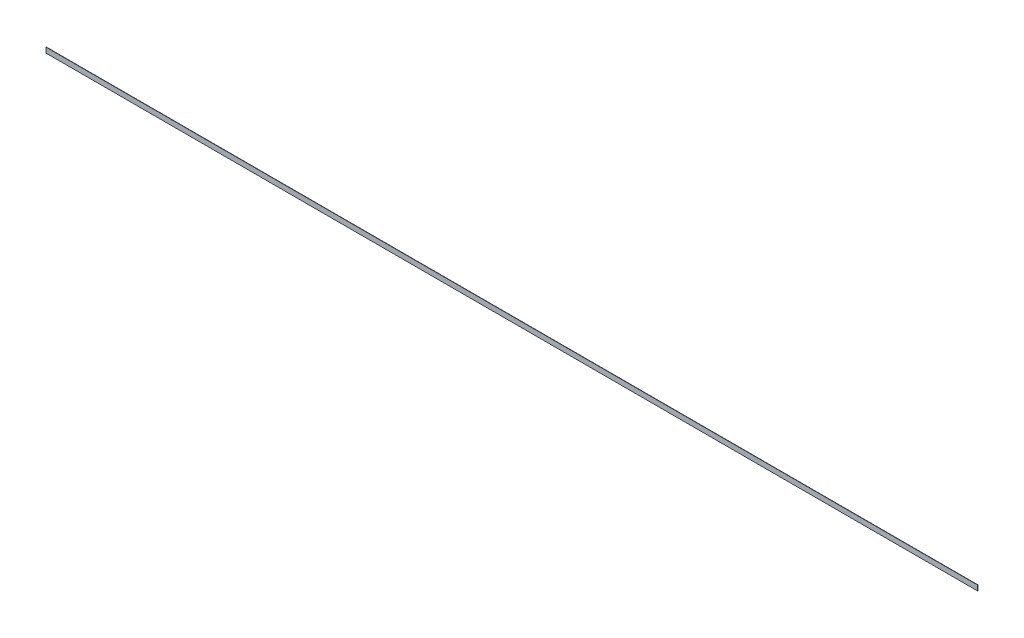
ISO-10303-21;
HEADER;
FILE_DESCRIPTION(('STEP AP214'),'2;1');
FILE_NAME('part.step','',(''),(''),'','','');
FILE_SCHEMA(('AUTOMOTIVE_DESIGN { 1 0 10303 214 1 1 1 1 }'));
ENDSEC;
DATA;
#1=APPLICATION_CONTEXT('core data for automotive mechanical design processes');
#2=APPLICATION_PROTOCOL_DEFINITION('international standard','automotive_design',2000,#1);
#3=PRODUCT_CONTEXT('',#1,'mechanical');
#4=PRODUCT('Part','Part','',(#3));
#5=PRODUCT_RELATED_PRODUCT_CATEGORY('part','',(#4));
#6=PRODUCT_DEFINITION_FORMATION('','',#4);
#7=PRODUCT_DEFINITION_CONTEXT('part definition',#1,'design');
#8=PRODUCT_DEFINITION('design','',#6,#7);
#9=PRODUCT_DEFINITION_SHAPE('','',#8);
#10=(LENGTH_UNIT() NAMED_UNIT(*) SI_UNIT(.MILLI.,.METRE.));
#11=(NAMED_UNIT(*) PLANE_ANGLE_UNIT() SI_UNIT($,.RADIAN.));
#12=(NAMED_UNIT(*) SI_UNIT($,.STERADIAN.) SOLID_ANGLE_UNIT());
#13=UNCERTAINTY_MEASURE_WITH_UNIT(LENGTH_MEASURE(1.E-05),#10,'distance_accuracy_value','');
#14=(GEOMETRIC_REPRESENTATION_CONTEXT(3) GLOBAL_UNCERTAINTY_ASSIGNED_CONTEXT((#13)) GLOBAL_UNIT_ASSIGNED_CONTEXT((#10,
#11,#12)) REPRESENTATION_CONTEXT('',''));
#15=CARTESIAN_POINT('',(0.,0.,0.));
#16=DIRECTION('',(0.,0.,1.));
#17=DIRECTION('',(1.,0.,0.));
#18=AXIS2_PLACEMENT_3D('',#15,#16,#17);
#19=CARTESIAN_POINT('',(-4761.02167367935,852.935817998678,0.));
#20=DIRECTION('',(0.,0.,1.));
#21=DIRECTION('',(1.,0.,0.));
#22=AXIS2_PLACEMENT_3D('',#19,#20,#21);
#23=PLANE('',#22);
#24=DIRECTION('',(0.,1.,0.));
#25=VECTOR('',#24,1.);
#26=CARTESIAN_POINT('',(-189.021673679352,852.935817998678,0.));
#27=LINE('',#26,#25);
#28=CARTESIAN_POINT('',(-189.021673679352,827.535817998678,0.));
#29=VERTEX_POINT('',#28);
#30=CARTESIAN_POINT('',(-189.021673679352,878.335817998678,0.));
#31=VERTEX_POINT('',#30);
#32=EDGE_CURVE('E76',#29,#31,#27,.T.);
#33=ORIENTED_EDGE('',*,*,#32,.F.);
#34=DIRECTION('',(1.,0.,0.));
#35=VECTOR('',#34,1.);
#36=CARTESIAN_POINT('',(-4761.02167367935,827.535817998678,0.));
#37=LINE('',#36,#35);
#38=CARTESIAN_POINT('',(-9333.02167367935,827.535817998678,0.));
#39=VERTEX_POINT('',#38);
#40=EDGE_CURVE('E65',#29,#39,#37,.F.);
#41=ORIENTED_EDGE('',*,*,#40,.T.);
#42=DIRECTION('',(0.,1.,0.));
#43=VECTOR('',#42,1.);
#44=CARTESIAN_POINT('',(-9333.02167367935,852.935817998678,0.));
#45=LINE('',#44,#43);
#46=CARTESIAN_POINT('',(-9333.02167367935,878.335817998678,0.));
#47=VERTEX_POINT('',#46);
#48=EDGE_CURVE('E53',#39,#47,#45,.T.);
#49=ORIENTED_EDGE('',*,*,#48,.T.);
#50=DIRECTION('',(1.,0.,0.));
#51=VECTOR('',#50,1.);
#52=CARTESIAN_POINT('',(-4761.02167367935,878.335817998678,0.));
#53=LINE('',#52,#51);
#54=EDGE_CURVE('E17',#31,#47,#53,.F.);
#55=ORIENTED_EDGE('',*,*,#54,.F.);
#56=EDGE_LOOP('',(#33,#41,#49,#55));
#57=FACE_BOUND('',#56,.T.);
#58=ADVANCED_FACE('F14',(#57),#23,.F.);
#59=CARTESIAN_POINT('',(-4761.02167367935,878.335817998678,3.175));
#60=DIRECTION('',(0.,1.,0.));
#61=DIRECTION('',(0.,0.,1.));
#62=AXIS2_PLACEMENT_3D('',#59,#60,#61);
#63=PLANE('',#62);
#64=DIRECTION('',(1.,0.,0.));
#65=VECTOR('',#64,1.);
#66=CARTESIAN_POINT('',(-4761.02167367935,878.335817998678,3.175));
#67=LINE('',#66,#65);
#68=CARTESIAN_POINT('',(-189.021673679352,878.335817998678,3.175));
#69=VERTEX_POINT('',#68);
#70=CARTESIAN_POINT('',(-9333.02167367935,878.335817998678,3.175));
#71=VERTEX_POINT('',#70);
#72=EDGE_CURVE('E80',#69,#71,#67,.F.);
#73=ORIENTED_EDGE('',*,*,#72,.F.);
#74=DIRECTION('',(0.,0.,-1.));
#75=VECTOR('',#74,1.);
#76=CARTESIAN_POINT('',(-189.021673679352,878.335817998678,3.175));
#77=LINE('',#76,#75);
#78=EDGE_CURVE('E62',#31,#69,#77,.F.);
#79=ORIENTED_EDGE('',*,*,#78,.F.);
#80=ORIENTED_EDGE('',*,*,#54,.T.);
#81=DIRECTION('',(0.,0.,-1.));
#82=VECTOR('',#81,1.);
#83=CARTESIAN_POINT('',(-9333.02167367935,878.335817998678,3.175));
#84=LINE('',#83,#82);
#85=EDGE_CURVE('E59',#47,#71,#84,.F.);
#86=ORIENTED_EDGE('',*,*,#85,.T.);
#87=EDGE_LOOP('',(#73,#79,#80,#86));
#88=FACE_BOUND('',#87,.T.);
#89=ADVANCED_FACE('F58',(#88),#63,.T.);
#90=CARTESIAN_POINT('',(-9333.02167367935,852.935817998678,3.175));
#91=DIRECTION('',(1.,0.,0.));
#92=DIRECTION('',(0.,0.,-1.));
#93=AXIS2_PLACEMENT_3D('',#90,#91,#92);
#94=PLANE('',#93);
#95=DIRECTION('',(0.,0.,1.));
#96=VECTOR('',#95,1.);
#97=CARTESIAN_POINT('',(-9333.02167367935,827.535817998678,3.175));
#98=LINE('',#97,#96);
#99=CARTESIAN_POINT('',(-9333.02167367935,827.535817998678,3.175));
#100=VERTEX_POINT('',#99);
#101=EDGE_CURVE('E67',#39,#100,#98,.T.);
#102=ORIENTED_EDGE('',*,*,#101,.T.);
#103=DIRECTION('',(0.,1.,0.));
#104=VECTOR('',#103,1.);
#105=CARTESIAN_POINT('',(-9333.02167367935,852.935817998678,3.175));
#106=LINE('',#105,#104);
#107=EDGE_CURVE('E71',#71,#100,#106,.F.);
#108=ORIENTED_EDGE('',*,*,#107,.F.);
#109=ORIENTED_EDGE('',*,*,#85,.F.);
#110=ORIENTED_EDGE('',*,*,#48,.F.);
#111=EDGE_LOOP('',(#102,#108,#109,#110));
#112=FACE_BOUND('',#111,.T.);
#113=ADVANCED_FACE('F69',(#112),#94,.F.);
#114=CARTESIAN_POINT('',(-4761.02167367935,827.535817998678,3.175));
#115=DIRECTION('',(0.,1.,0.));
#116=DIRECTION('',(0.,0.,1.));
#117=AXIS2_PLACEMENT_3D('',#114,#115,#116);
#118=PLANE('',#117);
#119=DIRECTION('',(0.,0.,-1.));
#120=VECTOR('',#119,1.);
#121=CARTESIAN_POINT('',(-189.021673679352,827.535817998678,3.175));
#122=LINE('',#121,#120);
#123=CARTESIAN_POINT('',(-189.021673679352,827.535817998678,3.175));
#124=VERTEX_POINT('',#123);
#125=EDGE_CURVE('E32',#124,#29,#122,.T.);
#126=ORIENTED_EDGE('',*,*,#125,.F.);
#127=DIRECTION('',(1.,0.,0.));
#128=VECTOR('',#127,1.);
#129=CARTESIAN_POINT('',(-4761.02167367935,827.535817998678,3.175));
#130=LINE('',#129,#128);
#131=EDGE_CURVE('E23',#100,#124,#130,.T.);
#132=ORIENTED_EDGE('',*,*,#131,.F.);
#133=ORIENTED_EDGE('',*,*,#101,.F.);
#134=ORIENTED_EDGE('',*,*,#40,.F.);
#135=EDGE_LOOP('',(#126,#132,#133,#134));
#136=FACE_BOUND('',#135,.T.);
#137=ADVANCED_FACE('F86',(#136),#118,.F.);
#138=CARTESIAN_POINT('',(-189.021673679352,852.935817998678,3.175));
#139=DIRECTION('',(1.,0.,0.));
#140=DIRECTION('',(0.,0.,-1.));
#141=AXIS2_PLACEMENT_3D('',#138,#139,#140);
#142=PLANE('',#141);
#143=DIRECTION('',(0.,1.,0.));
#144=VECTOR('',#143,1.);
#145=CARTESIAN_POINT('',(-189.021673679352,852.935817998678,3.175));
#146=LINE('',#145,#144);
#147=EDGE_CURVE('E9',#124,#69,#146,.T.);
#148=ORIENTED_EDGE('',*,*,#147,.F.);
#149=ORIENTED_EDGE('',*,*,#125,.T.);
#150=ORIENTED_EDGE('',*,*,#32,.T.);
#151=ORIENTED_EDGE('',*,*,#78,.T.);
#152=EDGE_LOOP('',(#148,#149,#150,#151));
#153=FACE_BOUND('',#152,.T.);
#154=ADVANCED_FACE('F88',(#153),#142,.T.);
#155=CARTESIAN_POINT('',(-4761.02167367935,852.935817998678,3.175));
#156=DIRECTION('',(0.,0.,1.));
#157=DIRECTION('',(1.,0.,0.));
#158=AXIS2_PLACEMENT_3D('',#155,#156,#157);
#159=PLANE('',#158);
#160=ORIENTED_EDGE('',*,*,#131,.T.);
#161=ORIENTED_EDGE('',*,*,#147,.T.);
#162=ORIENTED_EDGE('',*,*,#72,.T.);
#163=ORIENTED_EDGE('',*,*,#107,.T.);
#164=EDGE_LOOP('',(#160,#161,#162,#163));
#165=FACE_BOUND('',#164,.T.);
#166=ADVANCED_FACE('F85',(#165),#159,.T.);
#167=CLOSED_SHELL('',(#58,#89,#113,#137,#154,#166));
#168=MANIFOLD_SOLID_BREP('B1',#167);
#169=ADVANCED_BREP_SHAPE_REPRESENTATION('',(#18,#168),#14);
#170=SHAPE_DEFINITION_REPRESENTATION(#9,#169);
ENDSEC;
END-ISO-10303-21;
